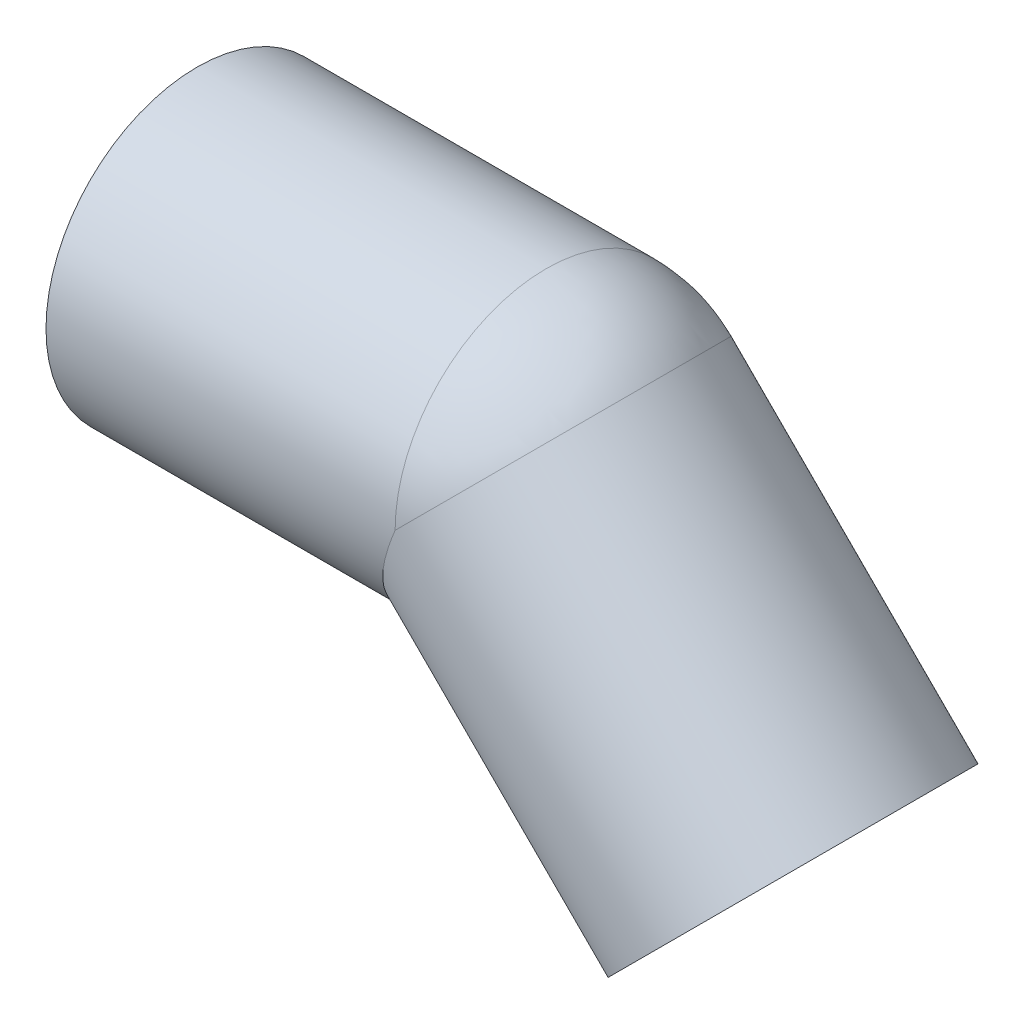
ISO-10303-21;
HEADER;
FILE_DESCRIPTION(('STEP AP214'),'2;1');
FILE_NAME('part.step','',(''),(''),'','','');
FILE_SCHEMA(('AUTOMOTIVE_DESIGN { 1 0 10303 214 1 1 1 1 }'));
ENDSEC;
DATA;
#1=APPLICATION_CONTEXT('core data for automotive mechanical design processes');
#2=APPLICATION_PROTOCOL_DEFINITION('international standard','automotive_design',2000,#1);
#3=PRODUCT_CONTEXT('',#1,'mechanical');
#4=PRODUCT('Part','Part','',(#3));
#5=PRODUCT_RELATED_PRODUCT_CATEGORY('part','',(#4));
#6=PRODUCT_DEFINITION_FORMATION('','',#4);
#7=PRODUCT_DEFINITION_CONTEXT('part definition',#1,'design');
#8=PRODUCT_DEFINITION('design','',#6,#7);
#9=PRODUCT_DEFINITION_SHAPE('','',#8);
#10=(LENGTH_UNIT() NAMED_UNIT(*) SI_UNIT(.MILLI.,.METRE.));
#11=(NAMED_UNIT(*) PLANE_ANGLE_UNIT() SI_UNIT($,.RADIAN.));
#12=(NAMED_UNIT(*) SI_UNIT($,.STERADIAN.) SOLID_ANGLE_UNIT());
#13=UNCERTAINTY_MEASURE_WITH_UNIT(LENGTH_MEASURE(1.E-05),#10,'distance_accuracy_value','');
#14=(GEOMETRIC_REPRESENTATION_CONTEXT(3) GLOBAL_UNCERTAINTY_ASSIGNED_CONTEXT((#13)) GLOBAL_UNIT_ASSIGNED_CONTEXT((#10,
#11,#12)) REPRESENTATION_CONTEXT('',''));
#15=CARTESIAN_POINT('',(0.,0.,0.));
#16=DIRECTION('',(0.,0.,1.));
#17=DIRECTION('',(1.,0.,0.));
#18=AXIS2_PLACEMENT_3D('',#15,#16,#17);
#19=CARTESIAN_POINT('',(177.5391052434,-73.5391052434065,0.));
#20=DIRECTION('',(-0.707106781186485,0.70710678118661,0.));
#21=DIRECTION('',(-0.70710678118661,-0.707106781186485,0.));
#22=AXIS2_PLACEMENT_3D('',#19,#20,#21);
#23=CYLINDRICAL_SURFACE('',#22,36.8);
#24=CARTESIAN_POINT('',(104.,0.,0.));
#25=DIRECTION('',(0.707106781186547,-0.707106781186548,0.));
#26=DIRECTION('',(0.,0.,-1.));
#27=AXIS2_PLACEMENT_3D('',#24,#25,#26);
#28=CIRCLE('',#27,36.8);
#29=CARTESIAN_POINT('',(130.021529550826,26.0215295445042,0.));
#30=VERTEX_POINT('',#29);
#31=CARTESIAN_POINT('',(104.000000000006,-2.28140043361846E-12,36.8));
#32=VERTEX_POINT('',#31);
#33=EDGE_CURVE('E53',#30,#32,#28,.T.);
#34=ORIENTED_EDGE('',*,*,#33,.F.);
#35=CARTESIAN_POINT('',(104.,0.,0.));
#36=DIRECTION('',(0.707106780928879,-0.707106781444216,0.));
#37=DIRECTION('',(0.,0.,-1.));
#38=AXIS2_PLACEMENT_3D('',#35,#36,#37);
#39=CIRCLE('',#38,36.8);
#40=CARTESIAN_POINT('',(104.000000000006,-2.27770875916035E-12,-36.8));
#41=VERTEX_POINT('',#40);
#42=EDGE_CURVE('E46',#41,#30,#39,.T.);
#43=ORIENTED_EDGE('',*,*,#42,.F.);
#44=CARTESIAN_POINT('',(104.000000000006,0.,0.));
#45=DIRECTION('',(-0.92387953251127,0.382683432365131,0.));
#46=DIRECTION('',(-0.382683432365131,-0.92387953251127,0.));
#47=AXIS2_PLACEMENT_3D('',#44,#45,#46);
#48=ELLIPSE('',#47,39.8320329707608,36.8);
#49=EDGE_CURVE('E55',#32,#41,#48,.F.);
#50=ORIENTED_EDGE('',*,*,#49,.F.);
#51=EDGE_LOOP('',(#34,#43,#50));
#52=FACE_BOUND('',#51,.T.);
#53=CARTESIAN_POINT('',(177.539105243395,-73.5391052434019,0.));
#54=DIRECTION('',(-0.707106781186485,0.70710678118661,0.));
#55=DIRECTION('',(-0.70710678118661,-0.707106781186485,0.));
#56=AXIS2_PLACEMENT_3D('',#53,#54,#55);
#57=CIRCLE('',#56,36.8);
#58=CARTESIAN_POINT('',(151.517575695728,-99.5606347910646,0.));
#59=VERTEX_POINT('',#58);
#60=EDGE_CURVE('E18',#59,#59,#57,.T.);
#61=ORIENTED_EDGE('',*,*,#60,.F.);
#62=EDGE_LOOP('',(#61));
#63=FACE_BOUND('',#62,.T.);
#64=ADVANCED_FACE('F15',(#52,#63),#23,.F.);
#65=CARTESIAN_POINT('',(104.,0.,0.));
#66=DIRECTION('',(0.,0.,1.));
#67=DIRECTION('',(-1.,0.,0.));
#68=AXIS2_PLACEMENT_3D('',#65,#66,#67);
#69=SPHERICAL_SURFACE('',#68,36.8);
#70=CARTESIAN_POINT('',(104.,0.,0.));
#71=DIRECTION('',(-1.,0.,0.));
#72=DIRECTION('',(0.,1.,0.));
#73=AXIS2_PLACEMENT_3D('',#70,#71,#72);
#74=CIRCLE('',#73,36.8);
#75=EDGE_CURVE('E51',#41,#32,#74,.F.);
#76=ORIENTED_EDGE('',*,*,#75,.F.);
#77=ORIENTED_EDGE('',*,*,#42,.T.);
#78=ORIENTED_EDGE('',*,*,#33,.T.);
#79=EDGE_LOOP('',(#76,#77,#78));
#80=FACE_BOUND('',#79,.T.);
#81=ADVANCED_FACE('F58',(#80),#69,.F.);
#82=CARTESIAN_POINT('',(209.358910396796,-41.7193000900063,45.5400021084175));
#83=DIRECTION('',(0.707106781186547,-0.707106781186548,0.));
#84=DIRECTION('',(-0.707106781186548,-0.707106781186547,0.));
#85=AXIS2_PLACEMENT_3D('',#82,#83,#84);
#86=PLANE('',#85);
#87=ORIENTED_EDGE('',*,*,#60,.T.);
#88=EDGE_LOOP('',(#87));
#89=FACE_BOUND('',#88,.T.);
#90=CARTESIAN_POINT('',(177.539105243394,-73.5391052434015,0.));
#91=DIRECTION('',(-0.707106781186478,0.707106781186617,0.));
#92=DIRECTION('',(-0.707106781186617,-0.707106781186478,0.));
#93=AXIS2_PLACEMENT_3D('',#90,#91,#92);
#94=CIRCLE('',#93,45.0000000000001);
#95=CARTESIAN_POINT('',(145.719300089996,-105.358910396793,0.));
#96=VERTEX_POINT('',#95);
#97=EDGE_CURVE('E71',#96,#96,#94,.T.);
#98=ORIENTED_EDGE('',*,*,#97,.F.);
#99=EDGE_LOOP('',(#98));
#100=FACE_BOUND('',#99,.T.);
#101=ADVANCED_FACE('F80',(#89,#100),#86,.T.);
#102=CARTESIAN_POINT('',(104.,0.,0.));
#103=DIRECTION('',(-1.,0.,0.));
#104=DIRECTION('',(0.,0.,1.));
#105=AXIS2_PLACEMENT_3D('',#102,#103,#104);
#106=CYLINDRICAL_SURFACE('',#105,36.8);
#107=CARTESIAN_POINT('',(0.,0.,0.));
#108=DIRECTION('',(-1.,0.,0.));
#109=DIRECTION('',(0.,0.,1.));
#110=AXIS2_PLACEMENT_3D('',#107,#108,#109);
#111=CIRCLE('',#110,36.8);
#112=CARTESIAN_POINT('',(0.,0.,36.8));
#113=VERTEX_POINT('',#112);
#114=EDGE_CURVE('E68',#113,#113,#111,.F.);
#115=ORIENTED_EDGE('',*,*,#114,.F.);
#116=EDGE_LOOP('',(#115));
#117=FACE_BOUND('',#116,.T.);
#118=ORIENTED_EDGE('',*,*,#49,.T.);
#119=ORIENTED_EDGE('',*,*,#75,.T.);
#120=EDGE_LOOP('',(#118,#119));
#121=FACE_BOUND('',#120,.T.);
#122=ADVANCED_FACE('F83',(#117,#121),#106,.F.);
#123=CARTESIAN_POINT('',(104.,0.,0.));
#124=DIRECTION('',(0.,0.,1.));
#125=DIRECTION('',(1.,0.,0.));
#126=AXIS2_PLACEMENT_3D('',#123,#124,#125);
#127=SPHERICAL_SURFACE('',#126,45.);
#128=CARTESIAN_POINT('',(104.,0.,0.));
#129=DIRECTION('',(-1.,0.,0.));
#130=DIRECTION('',(0.,1.,0.));
#131=AXIS2_PLACEMENT_3D('',#128,#129,#130);
#132=CIRCLE('',#131,45.);
#133=CARTESIAN_POINT('',(104.000000000006,-2.49709046397169E-12,45.));
#134=VERTEX_POINT('',#133);
#135=CARTESIAN_POINT('',(104.000000000006,-2.47152178067371E-12,-44.9999999999988));
#136=VERTEX_POINT('',#135);
#137=EDGE_CURVE('E67',#134,#136,#132,.T.);
#138=ORIENTED_EDGE('',*,*,#137,.F.);
#139=CARTESIAN_POINT('',(104.,0.,0.));
#140=DIRECTION('',(-0.707106781298352,0.707106781074743,0.));
#141=DIRECTION('',(0.,0.,1.));
#142=AXIS2_PLACEMENT_3D('',#139,#140,#141);
#143=CIRCLE('',#142,45.);
#144=CARTESIAN_POINT('',(135.819805150881,31.8198051559087,0.));
#145=VERTEX_POINT('',#144);
#146=EDGE_CURVE('E73',#134,#145,#143,.T.);
#147=ORIENTED_EDGE('',*,*,#146,.T.);
#148=CARTESIAN_POINT('',(104.000000000004,3.56659146660832E-12,0.));
#149=DIRECTION('',(-0.707106781186478,0.707106781186617,0.));
#150=DIRECTION('',(0.707106781186617,0.707106781186478,0.));
#151=AXIS2_PLACEMENT_3D('',#148,#149,#150);
#152=CIRCLE('',#151,44.999999999995);
#153=EDGE_CURVE('E33',#136,#145,#152,.F.);
#154=ORIENTED_EDGE('',*,*,#153,.F.);
#155=EDGE_LOOP('',(#138,#147,#154));
#156=FACE_BOUND('',#155,.T.);
#157=ADVANCED_FACE('F87',(#156),#127,.T.);
#158=CARTESIAN_POINT('',(104.000000000004,3.55618312575245E-12,0.));
#159=DIRECTION('',(-0.707106781186478,0.707106781186617,0.));
#160=DIRECTION('',(-0.707106781186617,-0.707106781186478,0.));
#161=AXIS2_PLACEMENT_3D('',#158,#159,#160);
#162=CYLINDRICAL_SURFACE('',#161,45.0000000000001);
#163=ORIENTED_EDGE('',*,*,#97,.T.);
#164=EDGE_LOOP('',(#163));
#165=FACE_BOUND('',#164,.T.);
#166=CARTESIAN_POINT('',(104.000000000007,0.,0.));
#167=DIRECTION('',(-0.923879532511268,0.382683432365135,0.));
#168=DIRECTION('',(-0.382683432365135,-0.923879532511268,0.));
#169=AXIS2_PLACEMENT_3D('',#166,#167,#168);
#170=ELLIPSE('',#169,48.7076490131588,45.);
#171=EDGE_CURVE('E24',#136,#134,#170,.T.);
#172=ORIENTED_EDGE('',*,*,#171,.F.);
#173=ORIENTED_EDGE('',*,*,#153,.T.);
#174=ORIENTED_EDGE('',*,*,#146,.F.);
#175=EDGE_LOOP('',(#172,#173,#174));
#176=FACE_BOUND('',#175,.T.);
#177=ADVANCED_FACE('F91',(#165,#176),#162,.T.);
#178=CARTESIAN_POINT('',(0.,-45.,45.5400021084174));
#179=DIRECTION('',(-1.,0.,0.));
#180=DIRECTION('',(0.,1.,0.));
#181=AXIS2_PLACEMENT_3D('',#178,#179,#180);
#182=PLANE('',#181);
#183=ORIENTED_EDGE('',*,*,#114,.T.);
#184=EDGE_LOOP('',(#183));
#185=FACE_BOUND('',#184,.T.);
#186=CARTESIAN_POINT('',(0.,0.,0.));
#187=DIRECTION('',(-1.,0.,0.));
#188=DIRECTION('',(0.,0.,1.));
#189=AXIS2_PLACEMENT_3D('',#186,#187,#188);
#190=CIRCLE('',#189,45.);
#191=CARTESIAN_POINT('',(0.,0.,45.));
#192=VERTEX_POINT('',#191);
#193=EDGE_CURVE('E9',#192,#192,#190,.F.);
#194=ORIENTED_EDGE('',*,*,#193,.F.);
#195=EDGE_LOOP('',(#194));
#196=FACE_BOUND('',#195,.T.);
#197=ADVANCED_FACE('F105',(#185,#196),#182,.T.);
#198=CARTESIAN_POINT('',(0.,0.,0.));
#199=DIRECTION('',(-1.,0.,0.));
#200=DIRECTION('',(0.,0.,1.));
#201=AXIS2_PLACEMENT_3D('',#198,#199,#200);
#202=CYLINDRICAL_SURFACE('',#201,45.);
#203=ORIENTED_EDGE('',*,*,#171,.T.);
#204=ORIENTED_EDGE('',*,*,#137,.T.);
#205=EDGE_LOOP('',(#203,#204));
#206=FACE_BOUND('',#205,.T.);
#207=ORIENTED_EDGE('',*,*,#193,.T.);
#208=EDGE_LOOP('',(#207));
#209=FACE_BOUND('',#208,.T.);
#210=ADVANCED_FACE('F102',(#206,#209),#202,.T.);
#211=CLOSED_SHELL('',(#64,#81,#101,#122,#157,#177,#197,#210));
#212=MANIFOLD_SOLID_BREP('B1',#211);
#213=ADVANCED_BREP_SHAPE_REPRESENTATION('',(#18,#212),#14);
#214=SHAPE_DEFINITION_REPRESENTATION(#9,#213);
ENDSEC;
END-ISO-10303-21;
